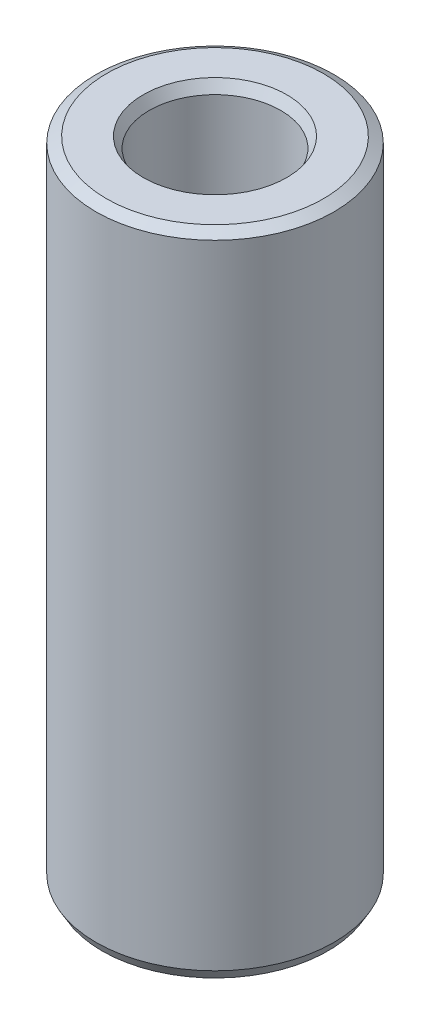
ISO-10303-21;
HEADER;
FILE_DESCRIPTION(('STEP AP214'),'2;1');
FILE_NAME('part.step','',(''),(''),'','','');
FILE_SCHEMA(('AUTOMOTIVE_DESIGN { 1 0 10303 214 1 1 1 1 }'));
ENDSEC;
DATA;
#1=APPLICATION_CONTEXT('core data for automotive mechanical design processes');
#2=APPLICATION_PROTOCOL_DEFINITION('international standard','automotive_design',2000,#1);
#3=PRODUCT_CONTEXT('',#1,'mechanical');
#4=PRODUCT('Part','Part','',(#3));
#5=PRODUCT_RELATED_PRODUCT_CATEGORY('part','',(#4));
#6=PRODUCT_DEFINITION_FORMATION('','',#4);
#7=PRODUCT_DEFINITION_CONTEXT('part definition',#1,'design');
#8=PRODUCT_DEFINITION('design','',#6,#7);
#9=PRODUCT_DEFINITION_SHAPE('','',#8);
#10=(LENGTH_UNIT() NAMED_UNIT(*) SI_UNIT(.MILLI.,.METRE.));
#11=(NAMED_UNIT(*) PLANE_ANGLE_UNIT() SI_UNIT($,.RADIAN.));
#12=(NAMED_UNIT(*) SI_UNIT($,.STERADIAN.) SOLID_ANGLE_UNIT());
#13=UNCERTAINTY_MEASURE_WITH_UNIT(LENGTH_MEASURE(1.E-05),#10,'distance_accuracy_value','');
#14=(GEOMETRIC_REPRESENTATION_CONTEXT(3) GLOBAL_UNCERTAINTY_ASSIGNED_CONTEXT((#13)) GLOBAL_UNIT_ASSIGNED_CONTEXT((#10,
#11,#12)) REPRESENTATION_CONTEXT('',''));
#15=CARTESIAN_POINT('',(0.,0.,0.));
#16=DIRECTION('',(0.,0.,1.));
#17=DIRECTION('',(1.,0.,0.));
#18=AXIS2_PLACEMENT_3D('',#15,#16,#17);
#19=CARTESIAN_POINT('',(0.,231.87507066092,0.));
#20=DIRECTION('',(0.,-1.,0.));
#21=DIRECTION('',(0.,0.,-1.));
#22=AXIS2_PLACEMENT_3D('',#19,#20,#21);
#23=CYLINDRICAL_SURFACE('',#22,42.5);
#24=CARTESIAN_POINT('',(0.,3.75954452683086,0.));
#25=DIRECTION('',(0.,1.,0.));
#26=DIRECTION('',(0.,0.,1.));
#27=AXIS2_PLACEMENT_3D('',#24,#25,#26);
#28=CIRCLE('',#27,42.5);
#29=CARTESIAN_POINT('',(0.,3.75954452683083,-42.5));
#30=VERTEX_POINT('',#29);
#31=EDGE_CURVE('E10',#30,#30,#28,.T.);
#32=CARTESIAN_POINT('',(0.,229.704496616324,0.));
#33=DIRECTION('',(0.,1.,0.));
#34=DIRECTION('',(0.,0.,1.));
#35=AXIS2_PLACEMENT_3D('',#32,#33,#34);
#36=CIRCLE('',#35,42.5);
#37=CARTESIAN_POINT('',(0.,229.704496616324,-42.5));
#38=VERTEX_POINT('',#37);
#39=EDGE_CURVE('E50',#38,#38,#36,.F.);
#40=CARTESIAN_POINT('',(0.,3.75954452683083,-42.5));
#41=CARTESIAN_POINT('',(0.,6.11313777776305,-42.5));
#42=CARTESIAN_POINT('',(0.,8.46673102869526,-42.5));
#43=CARTESIAN_POINT('',(0.,13.1739175305597,-42.5));
#44=CARTESIAN_POINT('',(0.,15.5275107814919,-42.5));
#45=CARTESIAN_POINT('',(0.,20.2346972833564,-42.5));
#46=CARTESIAN_POINT('',(0.,22.5882905342886,-42.5));
#47=CARTESIAN_POINT('',(0.,27.295477036153,-42.5));
#48=CARTESIAN_POINT('',(0.,29.6490702870852,-42.5));
#49=CARTESIAN_POINT('',(0.,34.3562567889497,-42.5));
#50=CARTESIAN_POINT('',(0.,36.7098500398819,-42.5));
#51=CARTESIAN_POINT('',(0.,41.4170365417463,-42.5));
#52=CARTESIAN_POINT('',(0.,43.7706297926785,-42.5));
#53=CARTESIAN_POINT('',(0.,48.477816294543,-42.5));
#54=CARTESIAN_POINT('',(0.,50.8314095454752,-42.5));
#55=CARTESIAN_POINT('',(0.,55.5385960473396,-42.5));
#56=CARTESIAN_POINT('',(0.,57.8921892982718,-42.5));
#57=CARTESIAN_POINT('',(0.,62.5993758001363,-42.5));
#58=CARTESIAN_POINT('',(0.,64.9529690510685,-42.5));
#59=CARTESIAN_POINT('',(0.,69.6601555529329,-42.5));
#60=CARTESIAN_POINT('',(0.,72.0137488038651,-42.5));
#61=CARTESIAN_POINT('',(0.,76.7209353057296,-42.5));
#62=CARTESIAN_POINT('',(0.,79.0745285566618,-42.5));
#63=CARTESIAN_POINT('',(0.,83.7817150585262,-42.5));
#64=CARTESIAN_POINT('',(0.,86.1353083094584,-42.5));
#65=CARTESIAN_POINT('',(0.,90.8424948113229,-42.5));
#66=CARTESIAN_POINT('',(0.,93.1960880622551,-42.5));
#67=CARTESIAN_POINT('',(0.,97.9032745641195,-42.5));
#68=CARTESIAN_POINT('',(0.,100.256867815052,-42.5));
#69=CARTESIAN_POINT('',(0.,104.964054316916,-42.5));
#70=CARTESIAN_POINT('',(0.,107.317647567848,-42.5));
#71=CARTESIAN_POINT('',(0.,112.024834069713,-42.5));
#72=CARTESIAN_POINT('',(0.,114.378427320645,-42.5));
#73=CARTESIAN_POINT('',(0.,119.085613822509,-42.5));
#74=CARTESIAN_POINT('',(0.,121.439207073442,-42.5));
#75=CARTESIAN_POINT('',(0.,126.146393575306,-42.5));
#76=CARTESIAN_POINT('',(0.,128.499986826238,-42.5));
#77=CARTESIAN_POINT('',(0.,133.207173328103,-42.5));
#78=CARTESIAN_POINT('',(0.,135.560766579035,-42.5));
#79=CARTESIAN_POINT('',(0.,140.267953080899,-42.5));
#80=CARTESIAN_POINT('',(0.,142.621546331832,-42.5));
#81=CARTESIAN_POINT('',(0.,147.328732833696,-42.5));
#82=CARTESIAN_POINT('',(0.,149.682326084628,-42.5));
#83=CARTESIAN_POINT('',(0.,154.389512586493,-42.5));
#84=CARTESIAN_POINT('',(0.,156.743105837425,-42.5));
#85=CARTESIAN_POINT('',(0.,161.450292339289,-42.5));
#86=CARTESIAN_POINT('',(0.,163.803885590222,-42.5));
#87=CARTESIAN_POINT('',(0.,168.511072092086,-42.5));
#88=CARTESIAN_POINT('',(0.,170.864665343018,-42.5));
#89=CARTESIAN_POINT('',(0.,175.571851844883,-42.5));
#90=CARTESIAN_POINT('',(0.,177.925445095815,-42.5));
#91=CARTESIAN_POINT('',(0.,182.632631597679,-42.5));
#92=CARTESIAN_POINT('',(0.,184.986224848612,-42.5));
#93=CARTESIAN_POINT('',(0.,189.693411350476,-42.5));
#94=CARTESIAN_POINT('',(0.,192.047004601408,-42.5));
#95=CARTESIAN_POINT('',(0.,196.754191103273,-42.5));
#96=CARTESIAN_POINT('',(0.,199.107784354205,-42.5));
#97=CARTESIAN_POINT('',(0.,203.814970856069,-42.5));
#98=CARTESIAN_POINT('',(0.,206.168564107001,-42.5));
#99=CARTESIAN_POINT('',(0.,210.875750608866,-42.5));
#100=CARTESIAN_POINT('',(0.,213.229343859798,-42.5));
#101=CARTESIAN_POINT('',(0.,217.936530361663,-42.5));
#102=CARTESIAN_POINT('',(0.,220.290123612595,-42.5));
#103=CARTESIAN_POINT('',(0.,224.997310114459,-42.5));
#104=CARTESIAN_POINT('',(0.,227.350903365391,-42.5));
#105=CARTESIAN_POINT('',(0.,229.704496616324,-42.5));
#106=B_SPLINE_CURVE_WITH_KNOTS('',3,(#40,#41,#42,#43,#44,#45,#46,#47,#48,#49,#50,#51,#52,#53,
#54,#55,#56,#57,#58,#59,#60,#61,#62,#63,#64,#65,#66,#67,#68,#69,#70,#71,#72,#73,#74,#75,#76,#77,
#78,#79,#80,#81,#82,#83,#84,#85,#86,#87,#88,#89,#90,#91,#92,#93,#94,#95,#96,#97,#98,#99,#100,
#101,#102,#103,#104,#105),.UNSPECIFIED.,.F.,.F.,(4,2,2,2,2,2,2,2,2,2,2,2,2,2,2,2,2,2,2,2,2,2,2,
2,2,2,2,2,2,2,2,2,4),(0.,7.06077975279665,14.1215595055933,21.18233925839,28.2431190111866,
35.3038987639833,42.3646785167799,49.4254582695766,56.4862380223732,63.5470177751699,
70.6077975279665,77.6685772807631,84.7293570335598,91.7901367863565,98.8509165391531,
105.91169629195,112.972476044746,120.033255797543,127.09403555034,134.154815303136,
141.215595055933,148.27637480873,155.337154561526,162.397934314323,169.45871406712,
176.519493819916,183.580273572713,190.64105332551,197.701833078306,204.762612831103,
211.8233925839,218.884172336696,225.944952089493),.UNSPECIFIED.);
#107=EDGE_CURVE('BSEAM39',#30,#38,#106,.T.);
#108=ORIENTED_EDGE('',*,*,#31,.T.);
#109=ORIENTED_EDGE('',*,*,#39,.T.);
#110=ORIENTED_EDGE('',*,*,#107,.T.);
#111=ORIENTED_EDGE('',*,*,#107,.F.);
#112=EDGE_LOOP('',(#108,#110,#109,#111));
#113=FACE_BOUND('',#112,.T.);
#114=ADVANCED_FACE('F39',(#113),#23,.T.);
#115=CARTESIAN_POINT('',(0.,231.87507066092,0.));
#116=DIRECTION('',(0.,1.,0.));
#117=DIRECTION('',(0.,0.,1.));
#118=AXIS2_PLACEMENT_3D('',#115,#116,#117);
#119=PLANE('',#118);
#120=CARTESIAN_POINT('',(0.,231.87507066092,0.));
#121=DIRECTION('',(0.,1.,0.));
#122=DIRECTION('',(0.,0.,1.));
#123=AXIS2_PLACEMENT_3D('',#120,#121,#122);
#124=CIRCLE('',#123,25.6505671211274);
#125=CARTESIAN_POINT('',(0.,231.87507066092,25.6505671211274));
#126=VERTEX_POINT('',#125);
#127=EDGE_CURVE('E58',#126,#126,#124,.F.);
#128=ORIENTED_EDGE('',*,*,#127,.T.);
#129=EDGE_LOOP('',(#128));
#130=FACE_BOUND('',#129,.T.);
#131=CARTESIAN_POINT('',(0.,231.87507066092,0.));
#132=DIRECTION('',(0.,1.,0.));
#133=DIRECTION('',(0.,0.,1.));
#134=AXIS2_PLACEMENT_3D('',#131,#132,#133);
#135=CIRCLE('',#134,38.7404554731696);
#136=CARTESIAN_POINT('',(0.,231.87507066092,38.7404554731696));
#137=VERTEX_POINT('',#136);
#138=EDGE_CURVE('E61',#137,#137,#135,.T.);
#139=ORIENTED_EDGE('',*,*,#138,.T.);
#140=EDGE_LOOP('',(#139));
#141=FACE_BOUND('',#140,.T.);
#142=ADVANCED_FACE('F88',(#130,#141),#119,.T.);
#143=CARTESIAN_POINT('',(0.,0.,0.));
#144=DIRECTION('',(0.,1.,0.));
#145=DIRECTION('',(0.,0.,1.));
#146=AXIS2_PLACEMENT_3D('',#143,#144,#145);
#147=PLANE('',#146);
#148=CARTESIAN_POINT('',(0.,0.,0.));
#149=DIRECTION('',(0.,1.,0.));
#150=DIRECTION('',(0.,0.,1.));
#151=AXIS2_PLACEMENT_3D('',#148,#149,#150);
#152=CIRCLE('',#151,27.2395376033617);
#153=CARTESIAN_POINT('',(0.,0.,27.2395376033617));
#154=VERTEX_POINT('',#153);
#155=EDGE_CURVE('E51',#154,#154,#152,.T.);
#156=ORIENTED_EDGE('',*,*,#155,.T.);
#157=EDGE_LOOP('',(#156));
#158=FACE_BOUND('',#157,.T.);
#159=CARTESIAN_POINT('',(0.,0.,0.));
#160=DIRECTION('',(0.,1.,0.));
#161=DIRECTION('',(0.,0.,1.));
#162=AXIS2_PLACEMENT_3D('',#159,#160,#161);
#163=CIRCLE('',#162,40.3294259554038);
#164=CARTESIAN_POINT('',(0.,0.,40.3294259554038));
#165=VERTEX_POINT('',#164);
#166=EDGE_CURVE('E54',#165,#165,#163,.F.);
#167=ORIENTED_EDGE('',*,*,#166,.T.);
#168=EDGE_LOOP('',(#167));
#169=FACE_BOUND('',#168,.T.);
#170=ADVANCED_FACE('F83',(#158,#169),#147,.F.);
#171=CARTESIAN_POINT('',(0.,231.87507066092,0.));
#172=DIRECTION('',(0.,-1.,0.));
#173=DIRECTION('',(0.,0.,-1.));
#174=AXIS2_PLACEMENT_3D('',#171,#172,#173);
#175=CYLINDRICAL_SURFACE('',#174,23.4799930765313);
#176=CARTESIAN_POINT('',(0.,228.115526134089,0.));
#177=DIRECTION('',(0.,1.,0.));
#178=DIRECTION('',(0.,0.,1.));
#179=AXIS2_PLACEMENT_3D('',#176,#177,#178);
#180=CIRCLE('',#179,23.4799930765313);
#181=CARTESIAN_POINT('',(0.,228.115526134089,-23.4799930765313));
#182=VERTEX_POINT('',#181);
#183=EDGE_CURVE('E67',#182,#182,#180,.T.);
#184=CARTESIAN_POINT('',(0.,2.17057404459595,0.));
#185=DIRECTION('',(0.,1.,0.));
#186=DIRECTION('',(0.,0.,1.));
#187=AXIS2_PLACEMENT_3D('',#184,#185,#186);
#188=CIRCLE('',#187,23.4799930765313);
#189=CARTESIAN_POINT('',(0.,2.17057404459595,-23.4799930765313));
#190=VERTEX_POINT('',#189);
#191=EDGE_CURVE('E69',#190,#190,#188,.F.);
#192=CARTESIAN_POINT('',(0.,228.115526134089,-23.4799930765313));
#193=CARTESIAN_POINT('',(0.,225.761932883157,-23.4799930765313));
#194=CARTESIAN_POINT('',(0.,223.408339632224,-23.4799930765313));
#195=CARTESIAN_POINT('',(0.,218.70115313036,-23.4799930765313));
#196=CARTESIAN_POINT('',(0.,216.347559879428,-23.4799930765313));
#197=CARTESIAN_POINT('',(0.,211.640373377563,-23.4799930765313));
#198=CARTESIAN_POINT('',(0.,209.286780126631,-23.4799930765313));
#199=CARTESIAN_POINT('',(0.,204.579593624767,-23.4799930765313));
#200=CARTESIAN_POINT('',(0.,202.226000373834,-23.4799930765313));
#201=CARTESIAN_POINT('',(0.,197.51881387197,-23.4799930765313));
#202=CARTESIAN_POINT('',(0.,195.165220621038,-23.4799930765313));
#203=CARTESIAN_POINT('',(0.,190.458034119173,-23.4799930765313));
#204=CARTESIAN_POINT('',(0.,188.104440868241,-23.4799930765313));
#205=CARTESIAN_POINT('',(0.,183.397254366377,-23.4799930765313));
#206=CARTESIAN_POINT('',(0.,181.043661115444,-23.4799930765313));
#207=CARTESIAN_POINT('',(0.,176.33647461358,-23.4799930765313));
#208=CARTESIAN_POINT('',(0.,173.982881362648,-23.4799930765313));
#209=CARTESIAN_POINT('',(0.,169.275694860783,-23.4799930765313));
#210=CARTESIAN_POINT('',(0.,166.922101609851,-23.4799930765313));
#211=CARTESIAN_POINT('',(0.,162.214915107987,-23.4799930765313));
#212=CARTESIAN_POINT('',(0.,159.861321857055,-23.4799930765313));
#213=CARTESIAN_POINT('',(0.,155.15413535519,-23.4799930765313));
#214=CARTESIAN_POINT('',(0.,152.800542104258,-23.4799930765313));
#215=CARTESIAN_POINT('',(0.,148.093355602393,-23.4799930765313));
#216=CARTESIAN_POINT('',(0.,145.739762351461,-23.4799930765313));
#217=CARTESIAN_POINT('',(0.,141.032575849597,-23.4799930765313));
#218=CARTESIAN_POINT('',(0.,138.678982598665,-23.4799930765313));
#219=CARTESIAN_POINT('',(0.,133.9717960968,-23.4799930765313));
#220=CARTESIAN_POINT('',(0.,131.618202845868,-23.4799930765313));
#221=CARTESIAN_POINT('',(0.,126.911016344003,-23.4799930765313));
#222=CARTESIAN_POINT('',(0.,124.557423093071,-23.4799930765313));
#223=CARTESIAN_POINT('',(0.,119.850236591207,-23.4799930765313));
#224=CARTESIAN_POINT('',(0.,117.496643340275,-23.4799930765313));
#225=CARTESIAN_POINT('',(0.,112.78945683841,-23.4799930765313));
#226=CARTESIAN_POINT('',(0.,110.435863587478,-23.4799930765313));
#227=CARTESIAN_POINT('',(0.,105.728677085614,-23.4799930765313));
#228=CARTESIAN_POINT('',(0.,103.375083834681,-23.4799930765313));
#229=CARTESIAN_POINT('',(0.,98.6678973328169,-23.4799930765313));
#230=CARTESIAN_POINT('',(0.,96.3143040818847,-23.4799930765313));
#231=CARTESIAN_POINT('',(0.,91.6071175800202,-23.4799930765313));
#232=CARTESIAN_POINT('',(0.,89.253524329088,-23.4799930765313));
#233=CARTESIAN_POINT('',(0.,84.5463378272236,-23.4799930765313));
#234=CARTESIAN_POINT('',(0.,82.1927445762913,-23.4799930765313));
#235=CARTESIAN_POINT('',(0.,77.4855580744269,-23.4799930765313));
#236=CARTESIAN_POINT('',(0.,75.1319648234947,-23.4799930765313));
#237=CARTESIAN_POINT('',(0.,70.4247783216303,-23.4799930765313));
#238=CARTESIAN_POINT('',(0.,68.071185070698,-23.4799930765313));
#239=CARTESIAN_POINT('',(0.,63.3639985688336,-23.4799930765313));
#240=CARTESIAN_POINT('',(0.,61.0104053179014,-23.4799930765313));
#241=CARTESIAN_POINT('',(0.,56.303218816037,-23.4799930765313));
#242=CARTESIAN_POINT('',(0.,53.9496255651047,-23.4799930765313));
#243=CARTESIAN_POINT('',(0.,49.2424390632403,-23.4799930765313));
#244=CARTESIAN_POINT('',(0.,46.8888458123081,-23.4799930765313));
#245=CARTESIAN_POINT('',(0.,42.1816593104436,-23.4799930765313));
#246=CARTESIAN_POINT('',(0.,39.8280660595114,-23.4799930765313));
#247=CARTESIAN_POINT('',(0.,35.120879557647,-23.4799930765313));
#248=CARTESIAN_POINT('',(0.,32.7672863067148,-23.4799930765313));
#249=CARTESIAN_POINT('',(0.,28.0600998048503,-23.4799930765313));
#250=CARTESIAN_POINT('',(0.,25.7065065539181,-23.4799930765313));
#251=CARTESIAN_POINT('',(0.,20.9993200520537,-23.4799930765313));
#252=CARTESIAN_POINT('',(0.,18.6457268011215,-23.4799930765313));
#253=CARTESIAN_POINT('',(0.,13.938540299257,-23.4799930765313));
#254=CARTESIAN_POINT('',(0.,11.5849470483248,-23.4799930765313));
#255=CARTESIAN_POINT('',(0.,6.87776054646038,-23.4799930765313));
#256=CARTESIAN_POINT('',(0.,4.52416729552816,-23.4799930765313));
#257=CARTESIAN_POINT('',(0.,2.17057404459595,-23.4799930765313));
#258=B_SPLINE_CURVE_WITH_KNOTS('',3,(#192,#193,#194,#195,#196,#197,#198,#199,#200,#201,#202,
#203,#204,#205,#206,#207,#208,#209,#210,#211,#212,#213,#214,#215,#216,#217,#218,#219,#220,#221,
#222,#223,#224,#225,#226,#227,#228,#229,#230,#231,#232,#233,#234,#235,#236,#237,#238,#239,#240,
#241,#242,#243,#244,#245,#246,#247,#248,#249,#250,#251,#252,#253,#254,#255,#256,#257),
.UNSPECIFIED.,.F.,.F.,(4,2,2,2,2,2,2,2,2,2,2,2,2,2,2,2,2,2,2,2,2,2,2,2,2,2,2,2,2,2,2,2,4),(0.,
7.06077975279665,14.1215595055933,21.1823392583899,28.2431190111866,35.3038987639832,
42.3646785167799,49.4254582695766,56.4862380223732,63.5470177751699,70.6077975279665,
77.6685772807632,84.7293570335598,91.7901367863565,98.8509165391531,105.91169629195,
112.972476044746,120.033255797543,127.09403555034,134.154815303136,141.215595055933,
148.27637480873,155.337154561526,162.397934314323,169.45871406712,176.519493819916,
183.580273572713,190.64105332551,197.701833078306,204.762612831103,211.8233925839,
218.884172336696,225.944952089493),.UNSPECIFIED.);
#259=EDGE_CURVE('BSEAM71',#182,#190,#258,.T.);
#260=ORIENTED_EDGE('',*,*,#183,.T.);
#261=ORIENTED_EDGE('',*,*,#191,.T.);
#262=ORIENTED_EDGE('',*,*,#259,.T.);
#263=ORIENTED_EDGE('',*,*,#259,.F.);
#264=EDGE_LOOP('',(#260,#262,#261,#263));
#265=FACE_BOUND('',#264,.T.);
#266=ADVANCED_FACE('F71',(#265),#175,.F.);
#267=CARTESIAN_POINT('',(0.,228.115526134089,0.));
#268=DIRECTION('',(0.,1.,0.));
#269=DIRECTION('',(0.,0.,1.));
#270=AXIS2_PLACEMENT_3D('',#267,#268,#269);
#271=CONICAL_SURFACE('',#270,23.4799930765313,0.523598775598293);
#272=ORIENTED_EDGE('',*,*,#127,.F.);
#273=EDGE_LOOP('',(#272));
#274=FACE_BOUND('',#273,.T.);
#275=ORIENTED_EDGE('',*,*,#183,.F.);
#276=EDGE_LOOP('',(#275));
#277=FACE_BOUND('',#276,.T.);
#278=ADVANCED_FACE('F77',(#274,#277),#271,.F.);
#279=CARTESIAN_POINT('',(0.,0.,0.));
#280=DIRECTION('',(0.,-1.,0.));
#281=DIRECTION('',(0.,0.,-1.));
#282=AXIS2_PLACEMENT_3D('',#279,#280,#281);
#283=CONICAL_SURFACE('',#282,27.2395376033617,1.04719755119659);
#284=ORIENTED_EDGE('',*,*,#191,.F.);
#285=EDGE_LOOP('',(#284));
#286=FACE_BOUND('',#285,.T.);
#287=ORIENTED_EDGE('',*,*,#155,.F.);
#288=EDGE_LOOP('',(#287));
#289=FACE_BOUND('',#288,.T.);
#290=ADVANCED_FACE('F73',(#286,#289),#283,.F.);
#291=CARTESIAN_POINT('',(0.,3.75954452683086,0.));
#292=DIRECTION('',(0.,1.,0.));
#293=DIRECTION('',(0.,0.,1.));
#294=AXIS2_PLACEMENT_3D('',#291,#292,#293);
#295=CONICAL_SURFACE('',#294,42.5,0.523598775598303);
#296=ORIENTED_EDGE('',*,*,#166,.F.);
#297=EDGE_LOOP('',(#296));
#298=FACE_BOUND('',#297,.T.);
#299=ORIENTED_EDGE('',*,*,#31,.F.);
#300=EDGE_LOOP('',(#299));
#301=FACE_BOUND('',#300,.T.);
#302=ADVANCED_FACE('F76',(#298,#301),#295,.T.);
#303=CARTESIAN_POINT('',(0.,231.87507066092,0.));
#304=DIRECTION('',(0.,-1.,0.));
#305=DIRECTION('',(0.,0.,-1.));
#306=AXIS2_PLACEMENT_3D('',#303,#304,#305);
#307=CONICAL_SURFACE('',#306,38.7404554731696,1.04719755119659);
#308=ORIENTED_EDGE('',*,*,#39,.F.);
#309=EDGE_LOOP('',(#308));
#310=FACE_BOUND('',#309,.T.);
#311=ORIENTED_EDGE('',*,*,#138,.F.);
#312=EDGE_LOOP('',(#311));
#313=FACE_BOUND('',#312,.T.);
#314=ADVANCED_FACE('F45',(#310,#313),#307,.T.);
#315=CLOSED_SHELL('',(#114,#142,#170,#266,#278,#290,#302,#314));
#316=MANIFOLD_SOLID_BREP('B2',#315);
#317=ADVANCED_BREP_SHAPE_REPRESENTATION('',(#18,#316),#14);
#318=SHAPE_DEFINITION_REPRESENTATION(#9,#317);
ENDSEC;
END-ISO-10303-21;
